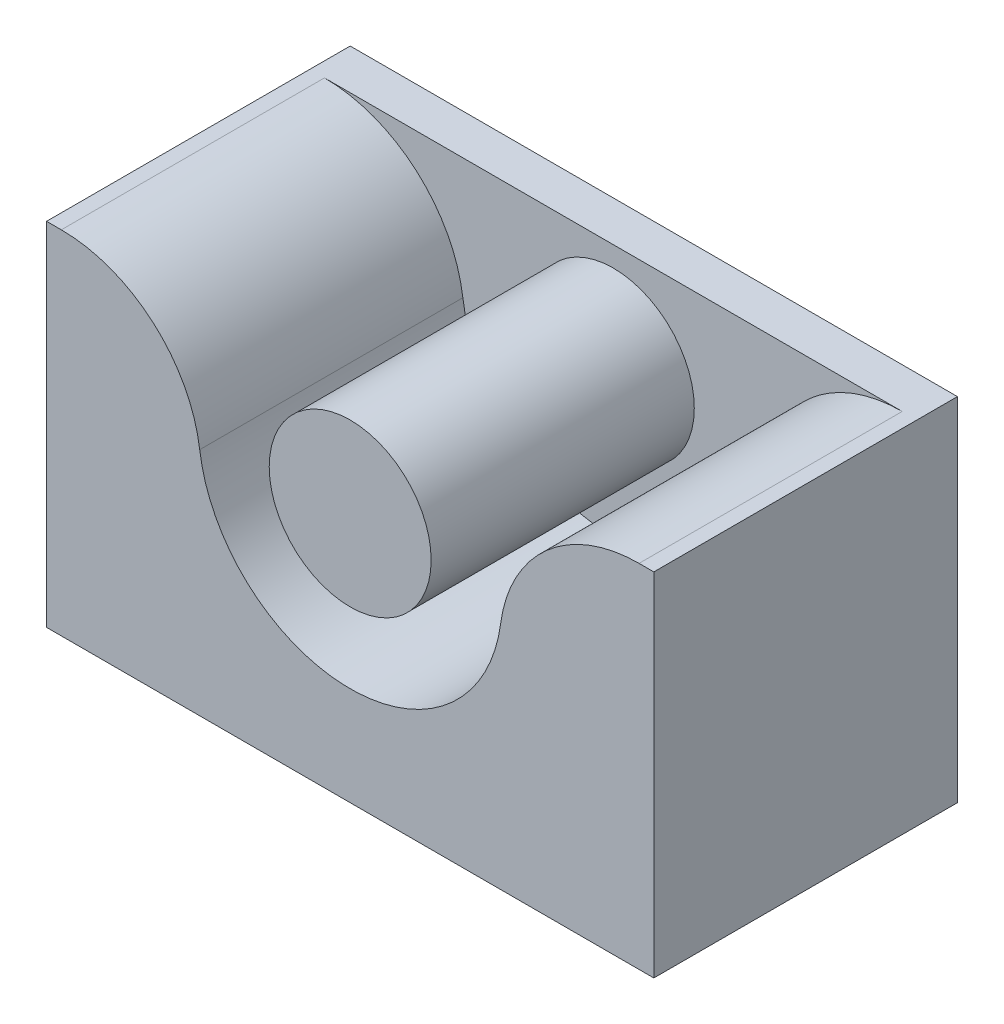
ISO-10303-21;
HEADER;
FILE_DESCRIPTION(('STEP AP214'),'2;1');
FILE_NAME('part.step','',(''),(''),'','','');
FILE_SCHEMA(('AUTOMOTIVE_DESIGN { 1 0 10303 214 1 1 1 1 }'));
ENDSEC;
DATA;
#1=APPLICATION_CONTEXT('core data for automotive mechanical design processes');
#2=APPLICATION_PROTOCOL_DEFINITION('international standard','automotive_design',2000,#1);
#3=PRODUCT_CONTEXT('',#1,'mechanical');
#4=PRODUCT('Part','Part','',(#3));
#5=PRODUCT_RELATED_PRODUCT_CATEGORY('part','',(#4));
#6=PRODUCT_DEFINITION_FORMATION('','',#4);
#7=PRODUCT_DEFINITION_CONTEXT('part definition',#1,'design');
#8=PRODUCT_DEFINITION('design','',#6,#7);
#9=PRODUCT_DEFINITION_SHAPE('','',#8);
#10=(LENGTH_UNIT() NAMED_UNIT(*) SI_UNIT(.MILLI.,.METRE.));
#11=(NAMED_UNIT(*) PLANE_ANGLE_UNIT() SI_UNIT($,.RADIAN.));
#12=(NAMED_UNIT(*) SI_UNIT($,.STERADIAN.) SOLID_ANGLE_UNIT());
#13=UNCERTAINTY_MEASURE_WITH_UNIT(LENGTH_MEASURE(1.E-05),#10,'distance_accuracy_value','');
#14=(GEOMETRIC_REPRESENTATION_CONTEXT(3) GLOBAL_UNCERTAINTY_ASSIGNED_CONTEXT((#13)) GLOBAL_UNIT_ASSIGNED_CONTEXT((#10,
#11,#12)) REPRESENTATION_CONTEXT('',''));
#15=CARTESIAN_POINT('',(0.,0.,0.));
#16=DIRECTION('',(0.,0.,1.));
#17=DIRECTION('',(1.,0.,0.));
#18=AXIS2_PLACEMENT_3D('',#15,#16,#17);
#19=CARTESIAN_POINT('',(14.9999999999999,-12.3750453764835,2.));
#20=DIRECTION('',(-1.,0.,0.));
#21=DIRECTION('',(0.,-1.,0.));
#22=AXIS2_PLACEMENT_3D('',#19,#20,#21);
#23=PLANE('',#22);
#24=DIRECTION('',(0.,1.,0.));
#25=VECTOR('',#24,1.);
#26=CARTESIAN_POINT('',(14.9999999999999,-12.3750453764835,0.));
#27=LINE('',#26,#25);
#28=CARTESIAN_POINT('',(14.9999999999999,-12.3750453764835,0.));
#29=VERTEX_POINT('',#28);
#30=CARTESIAN_POINT('',(15.,5.,0.));
#31=VERTEX_POINT('',#30);
#32=EDGE_CURVE('E153',#29,#31,#27,.T.);
#33=ORIENTED_EDGE('',*,*,#32,.T.);
#34=DIRECTION('',(0.,0.,-1.));
#35=VECTOR('',#34,1.);
#36=CARTESIAN_POINT('',(15.,5.,2.));
#37=LINE('',#36,#35);
#38=CARTESIAN_POINT('',(14.9999999999999,5.,15.));
#39=VERTEX_POINT('',#38);
#40=EDGE_CURVE('E40',#39,#31,#37,.T.);
#41=ORIENTED_EDGE('',*,*,#40,.F.);
#42=DIRECTION('',(0.,1.,0.));
#43=VECTOR('',#42,1.);
#44=CARTESIAN_POINT('',(14.9999999999999,5.,15.));
#45=LINE('',#44,#43);
#46=CARTESIAN_POINT('',(14.9999999999999,-12.3750453764835,15.));
#47=VERTEX_POINT('',#46);
#48=EDGE_CURVE('E115',#47,#39,#45,.T.);
#49=ORIENTED_EDGE('',*,*,#48,.F.);
#50=DIRECTION('',(0.,0.,-1.));
#51=VECTOR('',#50,1.);
#52=CARTESIAN_POINT('',(14.9999999999999,-12.3750453764835,2.));
#53=LINE('',#52,#51);
#54=EDGE_CURVE('E106',#47,#29,#53,.T.);
#55=ORIENTED_EDGE('',*,*,#54,.T.);
#56=EDGE_LOOP('',(#33,#41,#49,#55));
#57=FACE_BOUND('',#56,.T.);
#58=ADVANCED_FACE('F33',(#57),#23,.F.);
#59=CARTESIAN_POINT('',(-15.,5.,2.));
#60=DIRECTION('',(0.,-1.,0.));
#61=DIRECTION('',(0.,0.,-1.));
#62=AXIS2_PLACEMENT_3D('',#59,#60,#61);
#63=PLANE('',#62);
#64=DIRECTION('',(-1.,0.,0.));
#65=VECTOR('',#64,1.);
#66=CARTESIAN_POINT('',(-15.,5.,0.));
#67=LINE('',#66,#65);
#68=CARTESIAN_POINT('',(-15.,5.,0.));
#69=VERTEX_POINT('',#68);
#70=EDGE_CURVE('E158',#31,#69,#67,.T.);
#71=ORIENTED_EDGE('',*,*,#70,.T.);
#72=DIRECTION('',(0.,0.,-1.));
#73=VECTOR('',#72,1.);
#74=CARTESIAN_POINT('',(-15.,5.,2.));
#75=LINE('',#74,#73);
#76=CARTESIAN_POINT('',(-15.0000000000001,5.,15.));
#77=VERTEX_POINT('',#76);
#78=EDGE_CURVE('E105',#77,#69,#75,.T.);
#79=ORIENTED_EDGE('',*,*,#78,.F.);
#80=DIRECTION('',(-1.,0.,0.));
#81=VECTOR('',#80,1.);
#82=CARTESIAN_POINT('',(-15.0000000000001,5.,15.));
#83=LINE('',#82,#81);
#84=CARTESIAN_POINT('',(-14.2712935337709,5.,15.));
#85=VERTEX_POINT('',#84);
#86=EDGE_CURVE('E120',#85,#77,#83,.T.);
#87=ORIENTED_EDGE('',*,*,#86,.F.);
#88=DIRECTION('',(0.,0.,-1.));
#89=VECTOR('',#88,1.);
#90=CARTESIAN_POINT('',(-14.2712935337709,5.,15.));
#91=LINE('',#90,#89);
#92=CARTESIAN_POINT('',(-14.2712935337709,5.,2.));
#93=VERTEX_POINT('',#92);
#94=EDGE_CURVE('E137',#85,#93,#91,.T.);
#95=ORIENTED_EDGE('',*,*,#94,.T.);
#96=DIRECTION('',(-1.,0.,0.));
#97=VECTOR('',#96,1.);
#98=CARTESIAN_POINT('',(-15.,5.,2.));
#99=LINE('',#98,#97);
#100=CARTESIAN_POINT('',(14.2712935337709,5.,2.));
#101=VERTEX_POINT('',#100);
#102=EDGE_CURVE('E52',#101,#93,#99,.T.);
#103=ORIENTED_EDGE('',*,*,#102,.F.);
#104=DIRECTION('',(0.,0.,-1.));
#105=VECTOR('',#104,1.);
#106=CARTESIAN_POINT('',(14.2712935337709,5.,15.));
#107=LINE('',#106,#105);
#108=CARTESIAN_POINT('',(14.2712935337709,5.,15.));
#109=VERTEX_POINT('',#108);
#110=EDGE_CURVE('E150',#109,#101,#107,.T.);
#111=ORIENTED_EDGE('',*,*,#110,.F.);
#112=DIRECTION('',(-1.,0.,0.));
#113=VECTOR('',#112,1.);
#114=CARTESIAN_POINT('',(14.2712935337709,5.,15.));
#115=LINE('',#114,#113);
#116=EDGE_CURVE('E128',#39,#109,#115,.T.);
#117=ORIENTED_EDGE('',*,*,#116,.F.);
#118=ORIENTED_EDGE('',*,*,#40,.T.);
#119=EDGE_LOOP('',(#71,#79,#87,#95,#103,#111,#117,#118));
#120=FACE_BOUND('',#119,.T.);
#121=ADVANCED_FACE('F166',(#120),#63,.F.);
#122=CARTESIAN_POINT('',(-15.,5.,2.));
#123=DIRECTION('',(1.,0.,0.));
#124=DIRECTION('',(0.,1.,0.));
#125=AXIS2_PLACEMENT_3D('',#122,#123,#124);
#126=PLANE('',#125);
#127=DIRECTION('',(0.,-1.,0.));
#128=VECTOR('',#127,1.);
#129=CARTESIAN_POINT('',(-15.,5.,0.));
#130=LINE('',#129,#128);
#131=CARTESIAN_POINT('',(-15.0000000000001,-12.3750453764835,0.));
#132=VERTEX_POINT('',#131);
#133=EDGE_CURVE('E102',#69,#132,#130,.T.);
#134=ORIENTED_EDGE('',*,*,#133,.T.);
#135=DIRECTION('',(0.,0.,-1.));
#136=VECTOR('',#135,1.);
#137=CARTESIAN_POINT('',(-15.0000000000001,-12.3750453764835,2.));
#138=LINE('',#137,#136);
#139=CARTESIAN_POINT('',(-15.0000000000001,-12.3750453764835,15.));
#140=VERTEX_POINT('',#139);
#141=EDGE_CURVE('E95',#140,#132,#138,.T.);
#142=ORIENTED_EDGE('',*,*,#141,.F.);
#143=DIRECTION('',(0.,-1.,0.));
#144=VECTOR('',#143,1.);
#145=CARTESIAN_POINT('',(-15.0000000000001,5.,15.));
#146=LINE('',#145,#144);
#147=EDGE_CURVE('E100',#77,#140,#146,.T.);
#148=ORIENTED_EDGE('',*,*,#147,.F.);
#149=ORIENTED_EDGE('',*,*,#78,.T.);
#150=EDGE_LOOP('',(#134,#142,#148,#149));
#151=FACE_BOUND('',#150,.T.);
#152=ADVANCED_FACE('F97',(#151),#126,.F.);
#153=CARTESIAN_POINT('',(-15.0000000000001,-12.3750453764835,2.));
#154=DIRECTION('',(0.,1.,0.));
#155=DIRECTION('',(0.,0.,1.));
#156=AXIS2_PLACEMENT_3D('',#153,#154,#155);
#157=PLANE('',#156);
#158=DIRECTION('',(1.,0.,0.));
#159=VECTOR('',#158,1.);
#160=CARTESIAN_POINT('',(-15.0000000000001,-12.3750453764835,0.));
#161=LINE('',#160,#159);
#162=EDGE_CURVE('E155',#132,#29,#161,.T.);
#163=ORIENTED_EDGE('',*,*,#162,.T.);
#164=ORIENTED_EDGE('',*,*,#54,.F.);
#165=DIRECTION('',(1.,0.,0.));
#166=VECTOR('',#165,1.);
#167=CARTESIAN_POINT('',(-15.0000000000001,-12.3750453764835,15.));
#168=LINE('',#167,#166);
#169=EDGE_CURVE('E109',#140,#47,#168,.T.);
#170=ORIENTED_EDGE('',*,*,#169,.F.);
#171=ORIENTED_EDGE('',*,*,#141,.T.);
#172=EDGE_LOOP('',(#163,#164,#170,#171));
#173=FACE_BOUND('',#172,.T.);
#174=ADVANCED_FACE('F110',(#173),#157,.F.);
#175=CARTESIAN_POINT('',(0.,0.,2.));
#176=DIRECTION('',(0.,0.,-1.));
#177=DIRECTION('',(-1.,0.,0.));
#178=AXIS2_PLACEMENT_3D('',#175,#176,#177);
#179=PLANE('',#178);
#180=CARTESIAN_POINT('',(0.,0.,2.));
#181=DIRECTION('',(0.,0.,-1.));
#182=DIRECTION('',(-1.,0.,0.));
#183=AXIS2_PLACEMENT_3D('',#180,#181,#182);
#184=CIRCLE('',#183,4.);
#185=CARTESIAN_POINT('',(-4.,0.,2.));
#186=VERTEX_POINT('',#185);
#187=EDGE_CURVE('E11',#186,#186,#184,.F.);
#188=ORIENTED_EDGE('',*,*,#187,.F.);
#189=EDGE_LOOP('',(#188));
#190=FACE_BOUND('',#189,.T.);
#191=CARTESIAN_POINT('',(-14.2712935337709,-1.89679276508199,2.));
#192=DIRECTION('',(0.,0.,1.));
#193=DIRECTION('',(1.,0.,0.));
#194=AXIS2_PLACEMENT_3D('',#191,#192,#193);
#195=CIRCLE('',#194,6.89679276508199);
#196=CARTESIAN_POINT('',(-7.43462125556767,-0.988132980049458,2.));
#197=VERTEX_POINT('',#196);
#198=EDGE_CURVE('E47',#197,#93,#195,.T.);
#199=ORIENTED_EDGE('',*,*,#198,.F.);
#200=CARTESIAN_POINT('',(0.,0.,2.));
#201=DIRECTION('',(0.,0.,-1.));
#202=DIRECTION('',(1.,0.,0.));
#203=AXIS2_PLACEMENT_3D('',#200,#201,#202);
#204=CIRCLE('',#203,7.5);
#205=CARTESIAN_POINT('',(7.43462125556767,-0.988132980049457,2.));
#206=VERTEX_POINT('',#205);
#207=EDGE_CURVE('E122',#206,#197,#204,.T.);
#208=ORIENTED_EDGE('',*,*,#207,.F.);
#209=CARTESIAN_POINT('',(14.2712935337709,-1.89679276508199,2.));
#210=DIRECTION('',(0.,0.,1.));
#211=DIRECTION('',(-1.,0.,0.));
#212=AXIS2_PLACEMENT_3D('',#209,#210,#211);
#213=CIRCLE('',#212,6.89679276508199);
#214=EDGE_CURVE('E138',#101,#206,#213,.T.);
#215=ORIENTED_EDGE('',*,*,#214,.F.);
#216=ORIENTED_EDGE('',*,*,#102,.T.);
#217=EDGE_LOOP('',(#199,#208,#215,#216));
#218=FACE_BOUND('',#217,.T.);
#219=ADVANCED_FACE('F174',(#190,#218),#179,.F.);
#220=CARTESIAN_POINT('',(0.,0.,0.));
#221=DIRECTION('',(0.,0.,-1.));
#222=DIRECTION('',(-1.,0.,0.));
#223=AXIS2_PLACEMENT_3D('',#220,#221,#222);
#224=PLANE('',#223);
#225=ORIENTED_EDGE('',*,*,#32,.F.);
#226=ORIENTED_EDGE('',*,*,#162,.F.);
#227=ORIENTED_EDGE('',*,*,#133,.F.);
#228=ORIENTED_EDGE('',*,*,#70,.F.);
#229=EDGE_LOOP('',(#225,#226,#227,#228));
#230=FACE_BOUND('',#229,.T.);
#231=ADVANCED_FACE('F171',(#230),#224,.T.);
#232=CARTESIAN_POINT('',(14.2712935337709,-1.89679276508199,15.));
#233=DIRECTION('',(0.,0.,-1.));
#234=DIRECTION('',(-1.,0.,0.));
#235=AXIS2_PLACEMENT_3D('',#232,#233,#234);
#236=CYLINDRICAL_SURFACE('',#235,6.89679276508199);
#237=ORIENTED_EDGE('',*,*,#214,.T.);
#238=DIRECTION('',(0.,0.,-1.));
#239=VECTOR('',#238,1.);
#240=CARTESIAN_POINT('',(7.43462125556767,-0.988132980049457,15.));
#241=LINE('',#240,#239);
#242=CARTESIAN_POINT('',(7.43462125556767,-0.988132980049457,15.));
#243=VERTEX_POINT('',#242);
#244=EDGE_CURVE('E147',#243,#206,#241,.T.);
#245=ORIENTED_EDGE('',*,*,#244,.F.);
#246=CARTESIAN_POINT('',(14.2712935337709,-1.89679276508199,15.));
#247=DIRECTION('',(0.,0.,1.));
#248=DIRECTION('',(-1.,0.,0.));
#249=AXIS2_PLACEMENT_3D('',#246,#247,#248);
#250=CIRCLE('',#249,6.89679276508199);
#251=EDGE_CURVE('E130',#109,#243,#250,.T.);
#252=ORIENTED_EDGE('',*,*,#251,.F.);
#253=ORIENTED_EDGE('',*,*,#110,.T.);
#254=EDGE_LOOP('',(#237,#245,#252,#253));
#255=FACE_BOUND('',#254,.T.);
#256=ADVANCED_FACE('F173',(#255),#236,.T.);
#257=CARTESIAN_POINT('',(0.,0.,15.));
#258=DIRECTION('',(0.,0.,-1.));
#259=DIRECTION('',(-1.,0.,0.));
#260=AXIS2_PLACEMENT_3D('',#257,#258,#259);
#261=CYLINDRICAL_SURFACE('',#260,7.5);
#262=ORIENTED_EDGE('',*,*,#207,.T.);
#263=DIRECTION('',(0.,0.,-1.));
#264=VECTOR('',#263,1.);
#265=CARTESIAN_POINT('',(-7.43462125556767,-0.988132980049458,15.));
#266=LINE('',#265,#264);
#267=CARTESIAN_POINT('',(-7.43462125556767,-0.988132980049458,15.));
#268=VERTEX_POINT('',#267);
#269=EDGE_CURVE('E144',#268,#197,#266,.T.);
#270=ORIENTED_EDGE('',*,*,#269,.F.);
#271=CARTESIAN_POINT('',(0.,0.,15.));
#272=DIRECTION('',(0.,0.,-1.));
#273=DIRECTION('',(1.,0.,0.));
#274=AXIS2_PLACEMENT_3D('',#271,#272,#273);
#275=CIRCLE('',#274,7.5);
#276=EDGE_CURVE('E132',#243,#268,#275,.T.);
#277=ORIENTED_EDGE('',*,*,#276,.F.);
#278=ORIENTED_EDGE('',*,*,#244,.T.);
#279=EDGE_LOOP('',(#262,#270,#277,#278));
#280=FACE_BOUND('',#279,.T.);
#281=ADVANCED_FACE('F180',(#280),#261,.F.);
#282=CARTESIAN_POINT('',(-14.2712935337709,-1.89679276508199,15.));
#283=DIRECTION('',(0.,0.,-1.));
#284=DIRECTION('',(-1.,0.,0.));
#285=AXIS2_PLACEMENT_3D('',#282,#283,#284);
#286=CYLINDRICAL_SURFACE('',#285,6.89679276508199);
#287=ORIENTED_EDGE('',*,*,#198,.T.);
#288=ORIENTED_EDGE('',*,*,#94,.F.);
#289=CARTESIAN_POINT('',(-14.2712935337709,-1.89679276508199,15.));
#290=DIRECTION('',(0.,0.,1.));
#291=DIRECTION('',(1.,0.,0.));
#292=AXIS2_PLACEMENT_3D('',#289,#290,#291);
#293=CIRCLE('',#292,6.89679276508199);
#294=EDGE_CURVE('E134',#268,#85,#293,.T.);
#295=ORIENTED_EDGE('',*,*,#294,.F.);
#296=ORIENTED_EDGE('',*,*,#269,.T.);
#297=EDGE_LOOP('',(#287,#288,#295,#296));
#298=FACE_BOUND('',#297,.T.);
#299=ADVANCED_FACE('F220',(#298),#286,.T.);
#300=CARTESIAN_POINT('',(14.2712935337709,-1.89679276508199,15.));
#301=DIRECTION('',(0.,0.,-1.));
#302=DIRECTION('',(-1.,0.,0.));
#303=AXIS2_PLACEMENT_3D('',#300,#301,#302);
#304=PLANE('',#303);
#305=ORIENTED_EDGE('',*,*,#147,.T.);
#306=ORIENTED_EDGE('',*,*,#169,.T.);
#307=ORIENTED_EDGE('',*,*,#48,.T.);
#308=ORIENTED_EDGE('',*,*,#116,.T.);
#309=ORIENTED_EDGE('',*,*,#251,.T.);
#310=ORIENTED_EDGE('',*,*,#276,.T.);
#311=ORIENTED_EDGE('',*,*,#294,.T.);
#312=ORIENTED_EDGE('',*,*,#86,.T.);
#313=EDGE_LOOP('',(#305,#306,#307,#308,#309,#310,#311,#312));
#314=FACE_BOUND('',#313,.T.);
#315=ADVANCED_FACE('F118',(#314),#304,.F.);
#316=CARTESIAN_POINT('',(0.,0.,15.));
#317=DIRECTION('',(0.,0.,-1.));
#318=DIRECTION('',(-1.,0.,0.));
#319=AXIS2_PLACEMENT_3D('',#316,#317,#318);
#320=CYLINDRICAL_SURFACE('',#319,4.);
#321=CARTESIAN_POINT('',(0.,0.,15.));
#322=DIRECTION('',(0.,0.,1.));
#323=DIRECTION('',(1.,0.,0.));
#324=AXIS2_PLACEMENT_3D('',#321,#322,#323);
#325=CIRCLE('',#324,4.);
#326=CARTESIAN_POINT('',(4.,0.,15.));
#327=VERTEX_POINT('',#326);
#328=EDGE_CURVE('E125',#327,#327,#325,.T.);
#329=ORIENTED_EDGE('',*,*,#328,.F.);
#330=EDGE_LOOP('',(#329));
#331=FACE_BOUND('',#330,.T.);
#332=ORIENTED_EDGE('',*,*,#187,.T.);
#333=EDGE_LOOP('',(#332));
#334=FACE_BOUND('',#333,.T.);
#335=ADVANCED_FACE('F239',(#331,#334),#320,.T.);
#336=CARTESIAN_POINT('',(0.,0.,15.));
#337=DIRECTION('',(0.,0.,1.));
#338=DIRECTION('',(1.,0.,0.));
#339=AXIS2_PLACEMENT_3D('',#336,#337,#338);
#340=PLANE('',#339);
#341=ORIENTED_EDGE('',*,*,#328,.T.);
#342=EDGE_LOOP('',(#341));
#343=FACE_BOUND('',#342,.T.);
#344=ADVANCED_FACE('F248',(#343),#340,.T.);
#345=CLOSED_SHELL('',(#58,#121,#152,#174,#219,#231,#256,#281,#299,#315,#335,#344));
#346=MANIFOLD_SOLID_BREP('B2',#345);
#347=ADVANCED_BREP_SHAPE_REPRESENTATION('',(#18,#346),#14);
#348=SHAPE_DEFINITION_REPRESENTATION(#9,#347);
ENDSEC;
END-ISO-10303-21;
